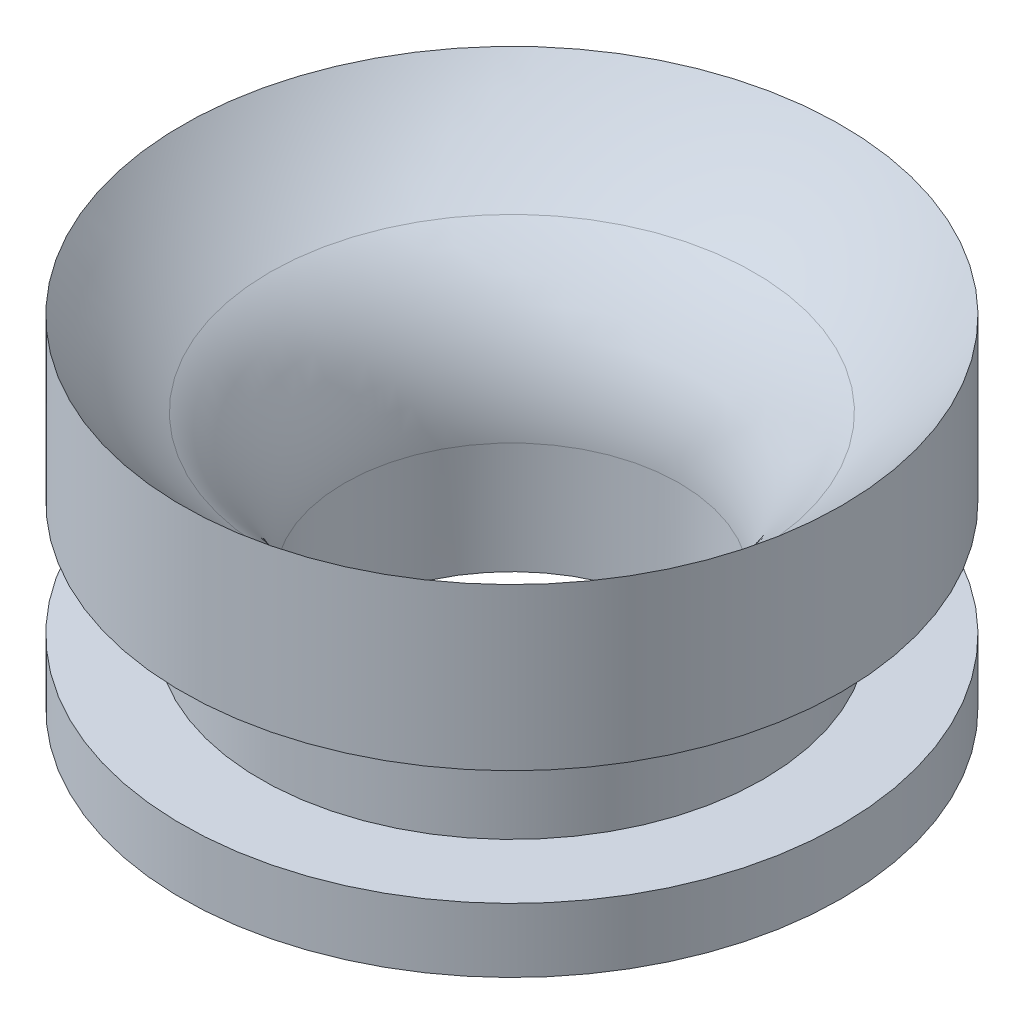
ISO-10303-21;
HEADER;
FILE_DESCRIPTION(('STEP AP214'),'2;1');
FILE_NAME('part.step','',(''),(''),'','','');
FILE_SCHEMA(('AUTOMOTIVE_DESIGN { 1 0 10303 214 1 1 1 1 }'));
ENDSEC;
DATA;
#1=APPLICATION_CONTEXT('core data for automotive mechanical design processes');
#2=APPLICATION_PROTOCOL_DEFINITION('international standard','automotive_design',2000,#1);
#3=PRODUCT_CONTEXT('',#1,'mechanical');
#4=PRODUCT('Part','Part','',(#3));
#5=PRODUCT_RELATED_PRODUCT_CATEGORY('part','',(#4));
#6=PRODUCT_DEFINITION_FORMATION('','',#4);
#7=PRODUCT_DEFINITION_CONTEXT('part definition',#1,'design');
#8=PRODUCT_DEFINITION('design','',#6,#7);
#9=PRODUCT_DEFINITION_SHAPE('','',#8);
#10=(LENGTH_UNIT() NAMED_UNIT(*) SI_UNIT(.MILLI.,.METRE.));
#11=(NAMED_UNIT(*) PLANE_ANGLE_UNIT() SI_UNIT($,.RADIAN.));
#12=(NAMED_UNIT(*) SI_UNIT($,.STERADIAN.) SOLID_ANGLE_UNIT());
#13=UNCERTAINTY_MEASURE_WITH_UNIT(LENGTH_MEASURE(1.E-05),#10,'distance_accuracy_value','');
#14=(GEOMETRIC_REPRESENTATION_CONTEXT(3) GLOBAL_UNCERTAINTY_ASSIGNED_CONTEXT((#13)) GLOBAL_UNIT_ASSIGNED_CONTEXT((#10,
#11,#12)) REPRESENTATION_CONTEXT('',''));
#15=CARTESIAN_POINT('',(0.,0.,0.));
#16=DIRECTION('',(0.,0.,1.));
#17=DIRECTION('',(1.,0.,0.));
#18=AXIS2_PLACEMENT_3D('',#15,#16,#17);
#19=CARTESIAN_POINT('',(0.,17.0097906077348,0.));
#20=DIRECTION('',(0.,-1.,0.));
#21=DIRECTION('',(1.,0.,0.));
#22=AXIS2_PLACEMENT_3D('',#19,#20,#21);
#23=SPHERICAL_SURFACE('',#22,11.9043906077348);
#24=CARTESIAN_POINT('',(0.,7.31440121840737,0.));
#25=DIRECTION('',(0.,1.,0.));
#26=DIRECTION('',(-1.,0.,0.));
#27=AXIS2_PLACEMENT_3D('',#24,#25,#26);
#28=CIRCLE('',#27,6.90752780166983);
#29=CARTESIAN_POINT('',(-6.90752780166983,7.31440121840737,0.));
#30=VERTEX_POINT('',#29);
#31=EDGE_CURVE('E41',#30,#30,#28,.F.);
#32=ORIENTED_EDGE('',*,*,#31,.T.);
#33=EDGE_LOOP('',(#32));
#34=FACE_BOUND('',#33,.T.);
#35=CARTESIAN_POINT('',(0.,9.7028,0.));
#36=DIRECTION('',(0.,-1.,0.));
#37=DIRECTION('',(1.,0.,0.));
#38=AXIS2_PLACEMENT_3D('',#35,#36,#37);
#39=CIRCLE('',#38,9.398);
#40=CARTESIAN_POINT('',(9.398,9.7028,0.));
#41=VERTEX_POINT('',#40);
#42=EDGE_CURVE('E54',#41,#41,#39,.T.);
#43=ORIENTED_EDGE('',*,*,#42,.F.);
#44=EDGE_LOOP('',(#43));
#45=FACE_BOUND('',#44,.T.);
#46=ADVANCED_FACE('F34',(#34,#45),#23,.F.);
#47=CARTESIAN_POINT('',(0.,0.,0.));
#48=DIRECTION('',(0.,-1.,0.));
#49=DIRECTION('',(1.,0.,0.));
#50=AXIS2_PLACEMENT_3D('',#47,#48,#49);
#51=CYLINDRICAL_SURFACE('',#50,9.398);
#52=ORIENTED_EDGE('',*,*,#42,.T.);
#53=EDGE_LOOP('',(#52));
#54=FACE_BOUND('',#53,.T.);
#55=CARTESIAN_POINT('',(0.,5.1054,0.));
#56=DIRECTION('',(0.,-1.,0.));
#57=DIRECTION('',(1.,0.,0.));
#58=AXIS2_PLACEMENT_3D('',#55,#56,#57);
#59=CIRCLE('',#58,9.398);
#60=CARTESIAN_POINT('',(9.398,5.1054,0.));
#61=VERTEX_POINT('',#60);
#62=EDGE_CURVE('E49',#61,#61,#59,.T.);
#63=ORIENTED_EDGE('',*,*,#62,.F.);
#64=EDGE_LOOP('',(#63));
#65=FACE_BOUND('',#64,.T.);
#66=ADVANCED_FACE('F77',(#54,#65),#51,.T.);
#67=CARTESIAN_POINT('',(0.,5.1054,0.));
#68=DIRECTION('',(0.,1.,0.));
#69=DIRECTION('',(-1.,0.,0.));
#70=AXIS2_PLACEMENT_3D('',#67,#68,#69);
#71=PLANE('',#70);
#72=CARTESIAN_POINT('',(0.,5.1054,0.));
#73=DIRECTION('',(0.,-1.,0.));
#74=DIRECTION('',(1.,0.,0.));
#75=AXIS2_PLACEMENT_3D('',#72,#73,#74);
#76=CIRCLE('',#75,7.1628);
#77=CARTESIAN_POINT('',(7.1628,5.1054,0.));
#78=VERTEX_POINT('',#77);
#79=EDGE_CURVE('E45',#78,#78,#76,.T.);
#80=ORIENTED_EDGE('',*,*,#79,.F.);
#81=EDGE_LOOP('',(#80));
#82=FACE_BOUND('',#81,.T.);
#83=ORIENTED_EDGE('',*,*,#62,.T.);
#84=EDGE_LOOP('',(#83));
#85=FACE_BOUND('',#84,.T.);
#86=ADVANCED_FACE('F90',(#82,#85),#71,.F.);
#87=CARTESIAN_POINT('',(0.,1.8288,0.));
#88=DIRECTION('',(0.,1.,0.));
#89=DIRECTION('',(-1.,0.,0.));
#90=AXIS2_PLACEMENT_3D('',#87,#88,#89);
#91=PLANE('',#90);
#92=CARTESIAN_POINT('',(0.,1.8288,0.));
#93=DIRECTION('',(0.,-1.,0.));
#94=DIRECTION('',(1.,0.,0.));
#95=AXIS2_PLACEMENT_3D('',#92,#93,#94);
#96=CIRCLE('',#95,7.1628);
#97=CARTESIAN_POINT('',(7.1628,1.8288,0.));
#98=VERTEX_POINT('',#97);
#99=EDGE_CURVE('E63',#98,#98,#96,.T.);
#100=ORIENTED_EDGE('',*,*,#99,.T.);
#101=EDGE_LOOP('',(#100));
#102=FACE_BOUND('',#101,.T.);
#103=CARTESIAN_POINT('',(0.,1.8288,0.));
#104=DIRECTION('',(0.,-1.,0.));
#105=DIRECTION('',(1.,0.,0.));
#106=AXIS2_PLACEMENT_3D('',#103,#104,#105);
#107=CIRCLE('',#106,9.398);
#108=CARTESIAN_POINT('',(9.398,1.8288,0.));
#109=VERTEX_POINT('',#108);
#110=EDGE_CURVE('E60',#109,#109,#107,.T.);
#111=ORIENTED_EDGE('',*,*,#110,.F.);
#112=EDGE_LOOP('',(#111));
#113=FACE_BOUND('',#112,.T.);
#114=ADVANCED_FACE('F82',(#102,#113),#91,.T.);
#115=CARTESIAN_POINT('',(0.,0.,0.));
#116=DIRECTION('',(0.,-1.,0.));
#117=DIRECTION('',(1.,0.,0.));
#118=AXIS2_PLACEMENT_3D('',#115,#116,#117);
#119=CYLINDRICAL_SURFACE('',#118,9.398);
#120=ORIENTED_EDGE('',*,*,#110,.T.);
#121=EDGE_LOOP('',(#120));
#122=FACE_BOUND('',#121,.T.);
#123=CARTESIAN_POINT('',(0.,0.,0.));
#124=DIRECTION('',(0.,-1.,0.));
#125=DIRECTION('',(1.,0.,0.));
#126=AXIS2_PLACEMENT_3D('',#123,#124,#125);
#127=CIRCLE('',#126,9.398);
#128=CARTESIAN_POINT('',(9.398,0.,0.));
#129=VERTEX_POINT('',#128);
#130=EDGE_CURVE('E57',#129,#129,#127,.T.);
#131=ORIENTED_EDGE('',*,*,#130,.F.);
#132=EDGE_LOOP('',(#131));
#133=FACE_BOUND('',#132,.T.);
#134=ADVANCED_FACE('F80',(#122,#133),#119,.T.);
#135=CARTESIAN_POINT('',(0.,0.,0.));
#136=DIRECTION('',(0.,-1.,0.));
#137=DIRECTION('',(1.,0.,0.));
#138=AXIS2_PLACEMENT_3D('',#135,#136,#137);
#139=CYLINDRICAL_SURFACE('',#138,7.1628);
#140=ORIENTED_EDGE('',*,*,#79,.T.);
#141=EDGE_LOOP('',(#140));
#142=FACE_BOUND('',#141,.T.);
#143=ORIENTED_EDGE('',*,*,#99,.F.);
#144=EDGE_LOOP('',(#143));
#145=FACE_BOUND('',#144,.T.);
#146=ADVANCED_FACE('F75',(#142,#145),#139,.T.);
#147=CARTESIAN_POINT('',(0.,0.,0.));
#148=DIRECTION('',(0.,-1.,0.));
#149=DIRECTION('',(1.,0.,0.));
#150=AXIS2_PLACEMENT_3D('',#147,#148,#149);
#151=PLANE('',#150);
#152=CARTESIAN_POINT('',(0.,0.,0.));
#153=DIRECTION('',(0.,-1.,0.));
#154=DIRECTION('',(1.,0.,0.));
#155=AXIS2_PLACEMENT_3D('',#152,#153,#154);
#156=CIRCLE('',#155,4.7752);
#157=CARTESIAN_POINT('',(4.7752,0.,0.));
#158=VERTEX_POINT('',#157);
#159=EDGE_CURVE('E66',#158,#158,#156,.T.);
#160=ORIENTED_EDGE('',*,*,#159,.F.);
#161=EDGE_LOOP('',(#160));
#162=FACE_BOUND('',#161,.T.);
#163=ORIENTED_EDGE('',*,*,#130,.T.);
#164=EDGE_LOOP('',(#163));
#165=FACE_BOUND('',#164,.T.);
#166=ADVANCED_FACE('F72',(#162,#165),#151,.T.);
#167=CARTESIAN_POINT('',(0.,12.446,0.));
#168=DIRECTION('',(0.,-1.,0.));
#169=DIRECTION('',(1.,0.,0.));
#170=AXIS2_PLACEMENT_3D('',#167,#168,#169);
#171=CYLINDRICAL_SURFACE('',#170,4.7752);
#172=CARTESIAN_POINT('',(0.,3.17705561872738,0.));
#173=DIRECTION('',(0.,1.,0.));
#174=DIRECTION('',(-1.,0.,0.));
#175=AXIS2_PLACEMENT_3D('',#172,#173,#174);
#176=CIRCLE('',#175,4.7752);
#177=CARTESIAN_POINT('',(-4.7752,3.17705561872738,0.));
#178=VERTEX_POINT('',#177);
#179=EDGE_CURVE('E10',#178,#178,#176,.T.);
#180=ORIENTED_EDGE('',*,*,#179,.T.);
#181=EDGE_LOOP('',(#180));
#182=FACE_BOUND('',#181,.T.);
#183=ORIENTED_EDGE('',*,*,#159,.T.);
#184=EDGE_LOOP('',(#183));
#185=FACE_BOUND('',#184,.T.);
#186=ADVANCED_FACE('F70',(#182,#185),#171,.F.);
#187=CARTESIAN_POINT('',(0.,3.17705561872738,0.));
#188=DIRECTION('',(0.,1.,0.));
#189=DIRECTION('',(-1.,0.,0.));
#190=AXIS2_PLACEMENT_3D('',#187,#188,#189);
#191=TOROIDAL_SURFACE('',#190,9.8552,5.08);
#192=ORIENTED_EDGE('',*,*,#179,.F.);
#193=EDGE_LOOP('',(#192));
#194=FACE_BOUND('',#193,.T.);
#195=ORIENTED_EDGE('',*,*,#31,.F.);
#196=EDGE_LOOP('',(#195));
#197=FACE_BOUND('',#196,.T.);
#198=ADVANCED_FACE('F36',(#194,#197),#191,.T.);
#199=CLOSED_SHELL('',(#46,#66,#86,#114,#134,#146,#166,#186,#198));
#200=MANIFOLD_SOLID_BREP('B2',#199);
#201=ADVANCED_BREP_SHAPE_REPRESENTATION('',(#18,#200),#14);
#202=SHAPE_DEFINITION_REPRESENTATION(#9,#201);
ENDSEC;
END-ISO-10303-21;
